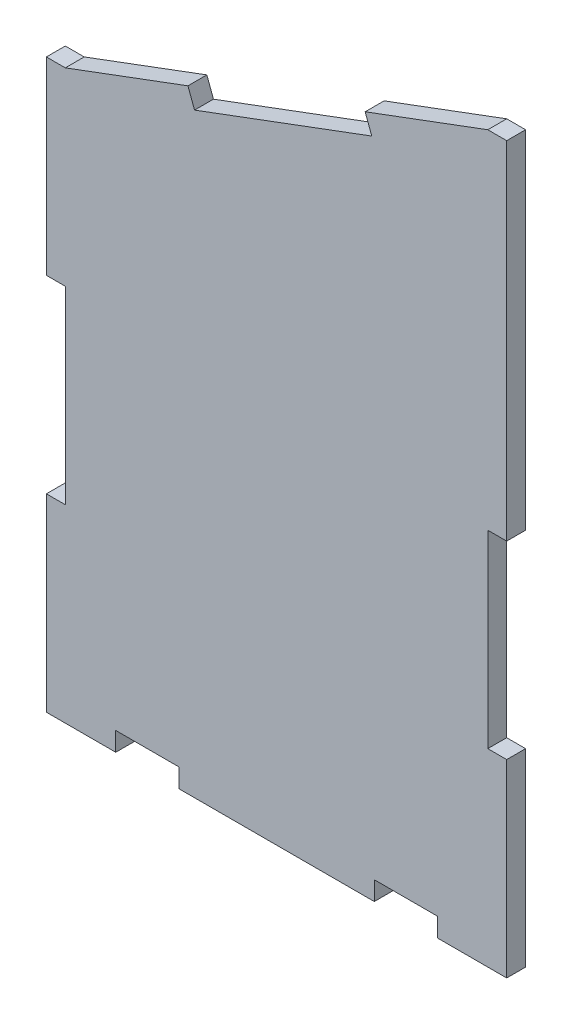
ISO-10303-21;
HEADER;
FILE_DESCRIPTION(('STEP AP214'),'2;1');
FILE_NAME('part.step','',(''),(''),'','','');
FILE_SCHEMA(('AUTOMOTIVE_DESIGN { 1 0 10303 214 1 1 1 1 }'));
ENDSEC;
DATA;
#1=APPLICATION_CONTEXT('core data for automotive mechanical design processes');
#2=APPLICATION_PROTOCOL_DEFINITION('international standard','automotive_design',2000,#1);
#3=PRODUCT_CONTEXT('',#1,'mechanical');
#4=PRODUCT('Part','Part','',(#3));
#5=PRODUCT_RELATED_PRODUCT_CATEGORY('part','',(#4));
#6=PRODUCT_DEFINITION_FORMATION('','',#4);
#7=PRODUCT_DEFINITION_CONTEXT('part definition',#1,'design');
#8=PRODUCT_DEFINITION('design','',#6,#7);
#9=PRODUCT_DEFINITION_SHAPE('','',#8);
#10=(LENGTH_UNIT() NAMED_UNIT(*) SI_UNIT(.MILLI.,.METRE.));
#11=(NAMED_UNIT(*) PLANE_ANGLE_UNIT() SI_UNIT($,.RADIAN.));
#12=(NAMED_UNIT(*) SI_UNIT($,.STERADIAN.) SOLID_ANGLE_UNIT());
#13=UNCERTAINTY_MEASURE_WITH_UNIT(LENGTH_MEASURE(1.E-05),#10,'distance_accuracy_value','');
#14=(GEOMETRIC_REPRESENTATION_CONTEXT(3) GLOBAL_UNCERTAINTY_ASSIGNED_CONTEXT((#13)) GLOBAL_UNIT_ASSIGNED_CONTEXT((#10,
#11,#12)) REPRESENTATION_CONTEXT('',''));
#15=CARTESIAN_POINT('',(0.,0.,0.));
#16=DIRECTION('',(0.,0.,1.));
#17=DIRECTION('',(1.,0.,0.));
#18=AXIS2_PLACEMENT_3D('',#15,#16,#17);
#19=CARTESIAN_POINT('',(271.856281381199,137.969765787973,3.));
#20=DIRECTION('',(-1.,0.,0.));
#21=DIRECTION('',(0.,0.,1.));
#22=AXIS2_PLACEMENT_3D('',#19,#20,#21);
#23=PLANE('',#22);
#24=DIRECTION('',(0.,1.,0.));
#25=VECTOR('',#24,1.);
#26=CARTESIAN_POINT('',(271.856281381199,137.969765787973,0.));
#27=LINE('',#26,#25);
#28=CARTESIAN_POINT('',(271.856281381199,134.969765787973,0.));
#29=VERTEX_POINT('',#28);
#30=CARTESIAN_POINT('',(271.856281381199,137.969765787973,0.));
#31=VERTEX_POINT('',#30);
#32=EDGE_CURVE('E237',#29,#31,#27,.T.);
#33=ORIENTED_EDGE('',*,*,#32,.T.);
#34=DIRECTION('',(0.,0.,-1.));
#35=VECTOR('',#34,1.);
#36=CARTESIAN_POINT('',(271.856281381199,137.969765787973,3.));
#37=LINE('',#36,#35);
#38=CARTESIAN_POINT('',(271.856281381199,137.969765787973,3.));
#39=VERTEX_POINT('',#38);
#40=EDGE_CURVE('E11',#39,#31,#37,.T.);
#41=ORIENTED_EDGE('',*,*,#40,.F.);
#42=DIRECTION('',(0.,1.,0.));
#43=VECTOR('',#42,1.);
#44=CARTESIAN_POINT('',(271.856281381199,137.969765787973,3.));
#45=LINE('',#44,#43);
#46=CARTESIAN_POINT('',(271.856281381199,134.969765787973,3.));
#47=VERTEX_POINT('',#46);
#48=EDGE_CURVE('E287',#47,#39,#45,.T.);
#49=ORIENTED_EDGE('',*,*,#48,.F.);
#50=DIRECTION('',(0.,0.,-1.));
#51=VECTOR('',#50,1.);
#52=CARTESIAN_POINT('',(271.856281381199,134.969765787973,3.));
#53=LINE('',#52,#51);
#54=EDGE_CURVE('E233',#47,#29,#53,.T.);
#55=ORIENTED_EDGE('',*,*,#54,.T.);
#56=EDGE_LOOP('',(#33,#41,#49,#55));
#57=FACE_BOUND('',#56,.T.);
#58=ADVANCED_FACE('F33',(#57),#23,.F.);
#59=CARTESIAN_POINT('',(281.856281381199,137.969765787973,3.));
#60=DIRECTION('',(0.,1.,0.));
#61=DIRECTION('',(-1.,0.,0.));
#62=AXIS2_PLACEMENT_3D('',#59,#60,#61);
#63=PLANE('',#62);
#64=DIRECTION('',(1.,0.,0.));
#65=VECTOR('',#64,1.);
#66=CARTESIAN_POINT('',(281.856281381199,137.969765787973,0.));
#67=LINE('',#66,#65);
#68=CARTESIAN_POINT('',(281.856281381199,137.969765787973,0.));
#69=VERTEX_POINT('',#68);
#70=EDGE_CURVE('E240',#31,#69,#67,.T.);
#71=ORIENTED_EDGE('',*,*,#70,.T.);
#72=DIRECTION('',(0.,0.,-1.));
#73=VECTOR('',#72,1.);
#74=CARTESIAN_POINT('',(281.856281381199,137.969765787973,3.));
#75=LINE('',#74,#73);
#76=CARTESIAN_POINT('',(281.856281381199,137.969765787973,3.));
#77=VERTEX_POINT('',#76);
#78=EDGE_CURVE('E41',#77,#69,#75,.T.);
#79=ORIENTED_EDGE('',*,*,#78,.F.);
#80=DIRECTION('',(1.,0.,0.));
#81=VECTOR('',#80,1.);
#82=CARTESIAN_POINT('',(281.856281381199,137.969765787973,3.));
#83=LINE('',#82,#81);
#84=EDGE_CURVE('E146',#39,#77,#83,.T.);
#85=ORIENTED_EDGE('',*,*,#84,.F.);
#86=ORIENTED_EDGE('',*,*,#40,.T.);
#87=EDGE_LOOP('',(#71,#79,#85,#86));
#88=FACE_BOUND('',#87,.T.);
#89=ADVANCED_FACE('F435',(#88),#63,.F.);
#90=CARTESIAN_POINT('',(281.856281381199,134.969765787973,3.));
#91=DIRECTION('',(1.,0.,0.));
#92=DIRECTION('',(0.,0.,-1.));
#93=AXIS2_PLACEMENT_3D('',#90,#91,#92);
#94=PLANE('',#93);
#95=DIRECTION('',(0.,-1.,0.));
#96=VECTOR('',#95,1.);
#97=CARTESIAN_POINT('',(281.856281381199,134.969765787973,0.));
#98=LINE('',#97,#96);
#99=CARTESIAN_POINT('',(281.856281381199,134.969765787973,0.));
#100=VERTEX_POINT('',#99);
#101=EDGE_CURVE('E242',#69,#100,#98,.T.);
#102=ORIENTED_EDGE('',*,*,#101,.T.);
#103=DIRECTION('',(0.,0.,-1.));
#104=VECTOR('',#103,1.);
#105=CARTESIAN_POINT('',(281.856281381199,134.969765787973,3.));
#106=LINE('',#105,#104);
#107=CARTESIAN_POINT('',(281.856281381199,134.969765787973,3.));
#108=VERTEX_POINT('',#107);
#109=EDGE_CURVE('E348',#108,#100,#106,.T.);
#110=ORIENTED_EDGE('',*,*,#109,.F.);
#111=DIRECTION('',(0.,-1.,0.));
#112=VECTOR('',#111,1.);
#113=CARTESIAN_POINT('',(281.856281381199,134.969765787973,3.));
#114=LINE('',#113,#112);
#115=EDGE_CURVE('E356',#77,#108,#114,.T.);
#116=ORIENTED_EDGE('',*,*,#115,.F.);
#117=ORIENTED_EDGE('',*,*,#78,.T.);
#118=EDGE_LOOP('',(#102,#110,#116,#117));
#119=FACE_BOUND('',#118,.T.);
#120=ADVANCED_FACE('F354',(#119),#94,.F.);
#121=CARTESIAN_POINT('',(292.856281381199,134.969765787973,3.));
#122=DIRECTION('',(0.,1.,0.));
#123=DIRECTION('',(-1.,0.,0.));
#124=AXIS2_PLACEMENT_3D('',#121,#122,#123);
#125=PLANE('',#124);
#126=DIRECTION('',(1.,0.,0.));
#127=VECTOR('',#126,1.);
#128=CARTESIAN_POINT('',(292.856281381199,134.969765787973,0.));
#129=LINE('',#128,#127);
#130=CARTESIAN_POINT('',(292.856281381199,134.969765787973,0.));
#131=VERTEX_POINT('',#130);
#132=EDGE_CURVE('E244',#100,#131,#129,.T.);
#133=ORIENTED_EDGE('',*,*,#132,.T.);
#134=DIRECTION('',(0.,0.,-1.));
#135=VECTOR('',#134,1.);
#136=CARTESIAN_POINT('',(292.856281381199,134.969765787973,3.));
#137=LINE('',#136,#135);
#138=CARTESIAN_POINT('',(292.856281381199,134.969765787973,3.));
#139=VERTEX_POINT('',#138);
#140=EDGE_CURVE('E345',#139,#131,#137,.T.);
#141=ORIENTED_EDGE('',*,*,#140,.F.);
#142=DIRECTION('',(1.,0.,0.));
#143=VECTOR('',#142,1.);
#144=CARTESIAN_POINT('',(292.856281381199,134.969765787973,3.));
#145=LINE('',#144,#143);
#146=EDGE_CURVE('E374',#108,#139,#145,.T.);
#147=ORIENTED_EDGE('',*,*,#146,.F.);
#148=ORIENTED_EDGE('',*,*,#109,.T.);
#149=EDGE_LOOP('',(#133,#141,#147,#148));
#150=FACE_BOUND('',#149,.T.);
#151=ADVANCED_FACE('F365',(#150),#125,.F.);
#152=CARTESIAN_POINT('',(292.856281381199,164.969765787973,3.));
#153=DIRECTION('',(-1.,0.,0.));
#154=DIRECTION('',(0.,-1.,0.));
#155=AXIS2_PLACEMENT_3D('',#152,#153,#154);
#156=PLANE('',#155);
#157=DIRECTION('',(0.,1.,0.));
#158=VECTOR('',#157,1.);
#159=CARTESIAN_POINT('',(292.856281381199,164.969765787973,0.));
#160=LINE('',#159,#158);
#161=CARTESIAN_POINT('',(292.856281381199,164.969765787973,0.));
#162=VERTEX_POINT('',#161);
#163=EDGE_CURVE('E246',#131,#162,#160,.T.);
#164=ORIENTED_EDGE('',*,*,#163,.T.);
#165=DIRECTION('',(0.,0.,-1.));
#166=VECTOR('',#165,1.);
#167=CARTESIAN_POINT('',(292.856281381199,164.969765787973,3.));
#168=LINE('',#167,#166);
#169=CARTESIAN_POINT('',(292.856281381199,164.969765787973,3.));
#170=VERTEX_POINT('',#169);
#171=EDGE_CURVE('E342',#170,#162,#168,.T.);
#172=ORIENTED_EDGE('',*,*,#171,.F.);
#173=DIRECTION('',(0.,1.,0.));
#174=VECTOR('',#173,1.);
#175=CARTESIAN_POINT('',(292.856281381199,164.969765787973,3.));
#176=LINE('',#175,#174);
#177=EDGE_CURVE('E371',#139,#170,#176,.T.);
#178=ORIENTED_EDGE('',*,*,#177,.F.);
#179=ORIENTED_EDGE('',*,*,#140,.T.);
#180=EDGE_LOOP('',(#164,#172,#178,#179));
#181=FACE_BOUND('',#180,.T.);
#182=ADVANCED_FACE('F369',(#181),#156,.F.);
#183=CARTESIAN_POINT('',(289.856281381199,164.969765787973,3.));
#184=DIRECTION('',(0.,-1.,0.));
#185=DIRECTION('',(0.,0.,-1.));
#186=AXIS2_PLACEMENT_3D('',#183,#184,#185);
#187=PLANE('',#186);
#188=DIRECTION('',(-1.,0.,0.));
#189=VECTOR('',#188,1.);
#190=CARTESIAN_POINT('',(289.856281381199,164.969765787973,0.));
#191=LINE('',#190,#189);
#192=CARTESIAN_POINT('',(289.856281381199,164.969765787973,0.));
#193=VERTEX_POINT('',#192);
#194=EDGE_CURVE('E248',#162,#193,#191,.T.);
#195=ORIENTED_EDGE('',*,*,#194,.T.);
#196=DIRECTION('',(0.,0.,-1.));
#197=VECTOR('',#196,1.);
#198=CARTESIAN_POINT('',(289.856281381199,164.969765787973,3.));
#199=LINE('',#198,#197);
#200=CARTESIAN_POINT('',(289.856281381199,164.969765787973,3.));
#201=VERTEX_POINT('',#200);
#202=EDGE_CURVE('E339',#201,#193,#199,.T.);
#203=ORIENTED_EDGE('',*,*,#202,.F.);
#204=DIRECTION('',(-1.,0.,0.));
#205=VECTOR('',#204,1.);
#206=CARTESIAN_POINT('',(289.856281381199,164.969765787973,3.));
#207=LINE('',#206,#205);
#208=EDGE_CURVE('E373',#170,#201,#207,.T.);
#209=ORIENTED_EDGE('',*,*,#208,.F.);
#210=ORIENTED_EDGE('',*,*,#171,.T.);
#211=EDGE_LOOP('',(#195,#203,#209,#210));
#212=FACE_BOUND('',#211,.T.);
#213=ADVANCED_FACE('F448',(#212),#187,.F.);
#214=CARTESIAN_POINT('',(289.856281381199,194.969765787973,3.));
#215=DIRECTION('',(-1.,0.,0.));
#216=DIRECTION('',(0.,0.,1.));
#217=AXIS2_PLACEMENT_3D('',#214,#215,#216);
#218=PLANE('',#217);
#219=DIRECTION('',(0.,1.,0.));
#220=VECTOR('',#219,1.);
#221=CARTESIAN_POINT('',(289.856281381199,194.969765787973,0.));
#222=LINE('',#221,#220);
#223=CARTESIAN_POINT('',(289.856281381199,194.969765787973,0.));
#224=VERTEX_POINT('',#223);
#225=EDGE_CURVE('E250',#193,#224,#222,.T.);
#226=ORIENTED_EDGE('',*,*,#225,.T.);
#227=DIRECTION('',(0.,0.,-1.));
#228=VECTOR('',#227,1.);
#229=CARTESIAN_POINT('',(289.856281381199,194.969765787973,3.));
#230=LINE('',#229,#228);
#231=CARTESIAN_POINT('',(289.856281381199,194.969765787973,3.));
#232=VERTEX_POINT('',#231);
#233=EDGE_CURVE('E336',#232,#224,#230,.T.);
#234=ORIENTED_EDGE('',*,*,#233,.F.);
#235=DIRECTION('',(0.,1.,0.));
#236=VECTOR('',#235,1.);
#237=CARTESIAN_POINT('',(289.856281381199,194.969765787973,3.));
#238=LINE('',#237,#236);
#239=EDGE_CURVE('E376',#201,#232,#238,.T.);
#240=ORIENTED_EDGE('',*,*,#239,.F.);
#241=ORIENTED_EDGE('',*,*,#202,.T.);
#242=EDGE_LOOP('',(#226,#234,#240,#241));
#243=FACE_BOUND('',#242,.T.);
#244=ADVANCED_FACE('F451',(#243),#218,.F.);
#245=CARTESIAN_POINT('',(289.856281381199,194.969765787973,3.));
#246=DIRECTION('',(0.,1.,0.));
#247=DIRECTION('',(-1.,0.,0.));
#248=AXIS2_PLACEMENT_3D('',#245,#246,#247);
#249=PLANE('',#248);
#250=DIRECTION('',(1.,0.,0.));
#251=VECTOR('',#250,1.);
#252=CARTESIAN_POINT('',(289.856281381199,194.969765787973,0.));
#253=LINE('',#252,#251);
#254=CARTESIAN_POINT('',(292.856281381199,194.969765787973,0.));
#255=VERTEX_POINT('',#254);
#256=EDGE_CURVE('E252',#224,#255,#253,.T.);
#257=ORIENTED_EDGE('',*,*,#256,.T.);
#258=DIRECTION('',(0.,0.,-1.));
#259=VECTOR('',#258,1.);
#260=CARTESIAN_POINT('',(292.856281381199,194.969765787973,3.));
#261=LINE('',#260,#259);
#262=CARTESIAN_POINT('',(292.856281381199,194.969765787973,3.));
#263=VERTEX_POINT('',#262);
#264=EDGE_CURVE('E333',#263,#255,#261,.T.);
#265=ORIENTED_EDGE('',*,*,#264,.F.);
#266=DIRECTION('',(1.,0.,0.));
#267=VECTOR('',#266,1.);
#268=CARTESIAN_POINT('',(289.856281381199,194.969765787973,3.));
#269=LINE('',#268,#267);
#270=EDGE_CURVE('E382',#232,#263,#269,.T.);
#271=ORIENTED_EDGE('',*,*,#270,.F.);
#272=ORIENTED_EDGE('',*,*,#233,.T.);
#273=EDGE_LOOP('',(#257,#265,#271,#272));
#274=FACE_BOUND('',#273,.T.);
#275=ADVANCED_FACE('F455',(#274),#249,.F.);
#276=CARTESIAN_POINT('',(292.856281381199,249.969765787973,3.));
#277=DIRECTION('',(-1.,0.,0.));
#278=DIRECTION('',(0.,0.,1.));
#279=AXIS2_PLACEMENT_3D('',#276,#277,#278);
#280=PLANE('',#279);
#281=DIRECTION('',(0.,1.,0.));
#282=VECTOR('',#281,1.);
#283=CARTESIAN_POINT('',(292.856281381199,249.969765787973,0.));
#284=LINE('',#283,#282);
#285=CARTESIAN_POINT('',(292.856281381199,249.969765787973,0.));
#286=VERTEX_POINT('',#285);
#287=EDGE_CURVE('E254',#255,#286,#284,.T.);
#288=ORIENTED_EDGE('',*,*,#287,.T.);
#289=DIRECTION('',(0.,0.,-1.));
#290=VECTOR('',#289,1.);
#291=CARTESIAN_POINT('',(292.856281381199,249.969765787973,3.));
#292=LINE('',#291,#290);
#293=CARTESIAN_POINT('',(292.856281381199,249.969765787973,3.));
#294=VERTEX_POINT('',#293);
#295=EDGE_CURVE('E330',#294,#286,#292,.T.);
#296=ORIENTED_EDGE('',*,*,#295,.F.);
#297=DIRECTION('',(0.,1.,0.));
#298=VECTOR('',#297,1.);
#299=CARTESIAN_POINT('',(292.856281381199,249.969765787973,3.));
#300=LINE('',#299,#298);
#301=EDGE_CURVE('E384',#263,#294,#300,.T.);
#302=ORIENTED_EDGE('',*,*,#301,.F.);
#303=ORIENTED_EDGE('',*,*,#264,.T.);
#304=EDGE_LOOP('',(#288,#296,#302,#303));
#305=FACE_BOUND('',#304,.T.);
#306=ADVANCED_FACE('F459',(#305),#280,.F.);
#307=CARTESIAN_POINT('',(292.856281381199,249.969765787973,3.));
#308=DIRECTION('',(0.,-1.,0.));
#309=DIRECTION('',(1.,0.,0.));
#310=AXIS2_PLACEMENT_3D('',#307,#308,#309);
#311=PLANE('',#310);
#312=DIRECTION('',(-1.,0.,0.));
#313=VECTOR('',#312,1.);
#314=CARTESIAN_POINT('',(292.856281381199,249.969765787973,0.));
#315=LINE('',#314,#313);
#316=CARTESIAN_POINT('',(289.856281381199,249.969765787973,0.));
#317=VERTEX_POINT('',#316);
#318=EDGE_CURVE('E256',#286,#317,#315,.T.);
#319=ORIENTED_EDGE('',*,*,#318,.T.);
#320=DIRECTION('',(0.,0.,-1.));
#321=VECTOR('',#320,1.);
#322=CARTESIAN_POINT('',(289.856281381199,249.969765787973,3.));
#323=LINE('',#322,#321);
#324=CARTESIAN_POINT('',(289.856281381199,249.969765787973,3.));
#325=VERTEX_POINT('',#324);
#326=EDGE_CURVE('E327',#325,#317,#323,.T.);
#327=ORIENTED_EDGE('',*,*,#326,.F.);
#328=DIRECTION('',(-1.,0.,0.));
#329=VECTOR('',#328,1.);
#330=CARTESIAN_POINT('',(292.856281381199,249.969765787973,3.));
#331=LINE('',#330,#329);
#332=EDGE_CURVE('E386',#294,#325,#331,.T.);
#333=ORIENTED_EDGE('',*,*,#332,.F.);
#334=ORIENTED_EDGE('',*,*,#295,.T.);
#335=EDGE_LOOP('',(#319,#327,#333,#334));
#336=FACE_BOUND('',#335,.T.);
#337=ADVANCED_FACE('F463',(#336),#311,.F.);
#338=CARTESIAN_POINT('',(270.410545368415,242.71372859985,3.));
#339=DIRECTION('',(0.349597520791812,-0.936899980497501,0.));
#340=DIRECTION('',(0.936899980497501,0.349597520791812,0.));
#341=AXIS2_PLACEMENT_3D('',#338,#339,#340);
#342=PLANE('',#341);
#343=DIRECTION('',(-0.936899980497501,-0.349597520791812,0.));
#344=VECTOR('',#343,1.);
#345=CARTESIAN_POINT('',(270.410545368415,242.71372859985,0.));
#346=LINE('',#345,#344);
#347=CARTESIAN_POINT('',(270.410545368415,242.71372859985,0.));
#348=VERTEX_POINT('',#347);
#349=EDGE_CURVE('E258',#317,#348,#346,.T.);
#350=ORIENTED_EDGE('',*,*,#349,.T.);
#351=DIRECTION('',(0.,0.,-1.));
#352=VECTOR('',#351,1.);
#353=CARTESIAN_POINT('',(270.410545368415,242.71372859985,3.));
#354=LINE('',#353,#352);
#355=CARTESIAN_POINT('',(270.410545368415,242.71372859985,3.));
#356=VERTEX_POINT('',#355);
#357=EDGE_CURVE('E324',#356,#348,#354,.T.);
#358=ORIENTED_EDGE('',*,*,#357,.F.);
#359=DIRECTION('',(-0.936899980497501,-0.349597520791812,0.));
#360=VECTOR('',#359,1.);
#361=CARTESIAN_POINT('',(270.410545368415,242.71372859985,3.));
#362=LINE('',#361,#360);
#363=EDGE_CURVE('E388',#325,#356,#362,.T.);
#364=ORIENTED_EDGE('',*,*,#363,.F.);
#365=ORIENTED_EDGE('',*,*,#326,.T.);
#366=EDGE_LOOP('',(#350,#358,#364,#365));
#367=FACE_BOUND('',#366,.T.);
#368=ADVANCED_FACE('F467',(#367),#342,.F.);
#369=CARTESIAN_POINT('',(270.410545368415,242.71372859985,3.));
#370=DIRECTION('',(0.936899980497545,0.349597520791695,0.));
#371=DIRECTION('',(-0.349597520791695,0.936899980497545,0.));
#372=AXIS2_PLACEMENT_3D('',#369,#370,#371);
#373=PLANE('',#372);
#374=DIRECTION('',(0.349597520791695,-0.936899980497545,0.));
#375=VECTOR('',#374,1.);
#376=CARTESIAN_POINT('',(270.410545368415,242.71372859985,0.));
#377=LINE('',#376,#375);
#378=CARTESIAN_POINT('',(271.45933793079,239.903028658358,0.));
#379=VERTEX_POINT('',#378);
#380=EDGE_CURVE('E260',#348,#379,#377,.T.);
#381=ORIENTED_EDGE('',*,*,#380,.T.);
#382=DIRECTION('',(0.,0.,-1.));
#383=VECTOR('',#382,1.);
#384=CARTESIAN_POINT('',(271.45933793079,239.903028658358,3.));
#385=LINE('',#384,#383);
#386=CARTESIAN_POINT('',(271.45933793079,239.903028658358,3.));
#387=VERTEX_POINT('',#386);
#388=EDGE_CURVE('E321',#387,#379,#385,.T.);
#389=ORIENTED_EDGE('',*,*,#388,.F.);
#390=DIRECTION('',(0.349597520791695,-0.936899980497545,0.));
#391=VECTOR('',#390,1.);
#392=CARTESIAN_POINT('',(270.410545368415,242.71372859985,3.));
#393=LINE('',#392,#391);
#394=EDGE_CURVE('E390',#356,#387,#393,.T.);
#395=ORIENTED_EDGE('',*,*,#394,.F.);
#396=ORIENTED_EDGE('',*,*,#357,.T.);
#397=EDGE_LOOP('',(#381,#389,#395,#396));
#398=FACE_BOUND('',#397,.T.);
#399=ADVANCED_FACE('F471',(#398),#373,.F.);
#400=CARTESIAN_POINT('',(271.45933793079,239.903028658358,3.));
#401=DIRECTION('',(0.349597520791822,-0.936899980497498,0.));
#402=DIRECTION('',(0.936899980497498,0.349597520791822,0.));
#403=AXIS2_PLACEMENT_3D('',#400,#401,#402);
#404=PLANE('',#403);
#405=DIRECTION('',(-0.936899980497498,-0.349597520791822,0.));
#406=VECTOR('',#405,1.);
#407=CARTESIAN_POINT('',(271.45933793079,239.903028658358,0.));
#408=LINE('',#407,#406);
#409=CARTESIAN_POINT('',(243.352338515865,229.415103034603,0.));
#410=VERTEX_POINT('',#409);
#411=EDGE_CURVE('E262',#379,#410,#408,.T.);
#412=ORIENTED_EDGE('',*,*,#411,.T.);
#413=DIRECTION('',(0.,0.,-1.));
#414=VECTOR('',#413,1.);
#415=CARTESIAN_POINT('',(243.352338515865,229.415103034603,3.));
#416=LINE('',#415,#414);
#417=CARTESIAN_POINT('',(243.352338515865,229.415103034603,3.));
#418=VERTEX_POINT('',#417);
#419=EDGE_CURVE('E318',#418,#410,#416,.T.);
#420=ORIENTED_EDGE('',*,*,#419,.F.);
#421=DIRECTION('',(-0.936899980497498,-0.349597520791822,0.));
#422=VECTOR('',#421,1.);
#423=CARTESIAN_POINT('',(271.45933793079,239.903028658358,3.));
#424=LINE('',#423,#422);
#425=EDGE_CURVE('E392',#387,#418,#424,.T.);
#426=ORIENTED_EDGE('',*,*,#425,.F.);
#427=ORIENTED_EDGE('',*,*,#388,.T.);
#428=EDGE_LOOP('',(#412,#420,#426,#427));
#429=FACE_BOUND('',#428,.T.);
#430=ADVANCED_FACE('F475',(#429),#404,.F.);
#431=CARTESIAN_POINT('',(242.30354595349,232.225802976096,3.));
#432=DIRECTION('',(-0.936899980497509,-0.349597520791792,0.));
#433=DIRECTION('',(0.349597520791792,-0.936899980497509,0.));
#434=AXIS2_PLACEMENT_3D('',#431,#432,#433);
#435=PLANE('',#434);
#436=DIRECTION('',(-0.349597520791792,0.936899980497509,0.));
#437=VECTOR('',#436,1.);
#438=CARTESIAN_POINT('',(242.30354595349,232.225802976096,0.));
#439=LINE('',#438,#437);
#440=CARTESIAN_POINT('',(242.30354595349,232.225802976096,0.));
#441=VERTEX_POINT('',#440);
#442=EDGE_CURVE('E264',#410,#441,#439,.T.);
#443=ORIENTED_EDGE('',*,*,#442,.T.);
#444=DIRECTION('',(0.,0.,-1.));
#445=VECTOR('',#444,1.);
#446=CARTESIAN_POINT('',(242.30354595349,232.225802976096,3.));
#447=LINE('',#446,#445);
#448=CARTESIAN_POINT('',(242.30354595349,232.225802976096,3.));
#449=VERTEX_POINT('',#448);
#450=EDGE_CURVE('E315',#449,#441,#447,.T.);
#451=ORIENTED_EDGE('',*,*,#450,.F.);
#452=DIRECTION('',(-0.349597520791792,0.936899980497509,0.));
#453=VECTOR('',#452,1.);
#454=CARTESIAN_POINT('',(242.30354595349,232.225802976096,3.));
#455=LINE('',#454,#453);
#456=EDGE_CURVE('E394',#418,#449,#455,.T.);
#457=ORIENTED_EDGE('',*,*,#456,.F.);
#458=ORIENTED_EDGE('',*,*,#419,.T.);
#459=EDGE_LOOP('',(#443,#451,#457,#458));
#460=FACE_BOUND('',#459,.T.);
#461=ADVANCED_FACE('F479',(#460),#435,.F.);
#462=CARTESIAN_POINT('',(222.857809940707,224.969765787973,3.));
#463=DIRECTION('',(0.349597520791819,-0.936899980497499,0.));
#464=DIRECTION('',(0.936899980497499,0.349597520791819,0.));
#465=AXIS2_PLACEMENT_3D('',#462,#463,#464);
#466=PLANE('',#465);
#467=DIRECTION('',(-0.936899980497499,-0.349597520791819,0.));
#468=VECTOR('',#467,1.);
#469=CARTESIAN_POINT('',(222.857809940707,224.969765787973,0.));
#470=LINE('',#469,#468);
#471=CARTESIAN_POINT('',(222.857809940707,224.969765787973,0.));
#472=VERTEX_POINT('',#471);
#473=EDGE_CURVE('E266',#441,#472,#470,.T.);
#474=ORIENTED_EDGE('',*,*,#473,.T.);
#475=DIRECTION('',(0.,0.,-1.));
#476=VECTOR('',#475,1.);
#477=CARTESIAN_POINT('',(222.857809940707,224.969765787973,3.));
#478=LINE('',#477,#476);
#479=CARTESIAN_POINT('',(222.857809940707,224.969765787973,3.));
#480=VERTEX_POINT('',#479);
#481=EDGE_CURVE('E312',#480,#472,#478,.T.);
#482=ORIENTED_EDGE('',*,*,#481,.F.);
#483=DIRECTION('',(-0.936899980497499,-0.349597520791819,0.));
#484=VECTOR('',#483,1.);
#485=CARTESIAN_POINT('',(222.857809940707,224.969765787973,3.));
#486=LINE('',#485,#484);
#487=EDGE_CURVE('E396',#449,#480,#486,.T.);
#488=ORIENTED_EDGE('',*,*,#487,.F.);
#489=ORIENTED_EDGE('',*,*,#450,.T.);
#490=EDGE_LOOP('',(#474,#482,#488,#489));
#491=FACE_BOUND('',#490,.T.);
#492=ADVANCED_FACE('F483',(#491),#466,.F.);
#493=CARTESIAN_POINT('',(219.857809940707,224.969765787973,3.));
#494=DIRECTION('',(0.,-1.,0.));
#495=DIRECTION('',(0.,0.,-1.));
#496=AXIS2_PLACEMENT_3D('',#493,#494,#495);
#497=PLANE('',#496);
#498=DIRECTION('',(-1.,0.,0.));
#499=VECTOR('',#498,1.);
#500=CARTESIAN_POINT('',(219.857809940707,224.969765787973,0.));
#501=LINE('',#500,#499);
#502=CARTESIAN_POINT('',(219.857809940707,224.969765787973,0.));
#503=VERTEX_POINT('',#502);
#504=EDGE_CURVE('E268',#472,#503,#501,.T.);
#505=ORIENTED_EDGE('',*,*,#504,.T.);
#506=DIRECTION('',(0.,0.,-1.));
#507=VECTOR('',#506,1.);
#508=CARTESIAN_POINT('',(219.857809940707,224.969765787973,3.));
#509=LINE('',#508,#507);
#510=CARTESIAN_POINT('',(219.857809940707,224.969765787973,3.));
#511=VERTEX_POINT('',#510);
#512=EDGE_CURVE('E309',#511,#503,#509,.T.);
#513=ORIENTED_EDGE('',*,*,#512,.F.);
#514=DIRECTION('',(-1.,0.,0.));
#515=VECTOR('',#514,1.);
#516=CARTESIAN_POINT('',(219.857809940707,224.969765787973,3.));
#517=LINE('',#516,#515);
#518=EDGE_CURVE('E398',#480,#511,#517,.T.);
#519=ORIENTED_EDGE('',*,*,#518,.F.);
#520=ORIENTED_EDGE('',*,*,#481,.T.);
#521=EDGE_LOOP('',(#505,#513,#519,#520));
#522=FACE_BOUND('',#521,.T.);
#523=ADVANCED_FACE('F487',(#522),#497,.F.);
#524=CARTESIAN_POINT('',(219.857809940707,194.969765787973,3.));
#525=DIRECTION('',(1.,0.,0.));
#526=DIRECTION('',(0.,1.,0.));
#527=AXIS2_PLACEMENT_3D('',#524,#525,#526);
#528=PLANE('',#527);
#529=DIRECTION('',(0.,-1.,0.));
#530=VECTOR('',#529,1.);
#531=CARTESIAN_POINT('',(219.857809940707,194.969765787973,0.));
#532=LINE('',#531,#530);
#533=CARTESIAN_POINT('',(219.857809940707,194.969765787973,0.));
#534=VERTEX_POINT('',#533);
#535=EDGE_CURVE('E270',#503,#534,#532,.T.);
#536=ORIENTED_EDGE('',*,*,#535,.T.);
#537=DIRECTION('',(0.,0.,-1.));
#538=VECTOR('',#537,1.);
#539=CARTESIAN_POINT('',(219.857809940707,194.969765787973,3.));
#540=LINE('',#539,#538);
#541=CARTESIAN_POINT('',(219.857809940707,194.969765787973,3.));
#542=VERTEX_POINT('',#541);
#543=EDGE_CURVE('E306',#542,#534,#540,.T.);
#544=ORIENTED_EDGE('',*,*,#543,.F.);
#545=DIRECTION('',(0.,-1.,0.));
#546=VECTOR('',#545,1.);
#547=CARTESIAN_POINT('',(219.857809940707,194.969765787973,3.));
#548=LINE('',#547,#546);
#549=EDGE_CURVE('E400',#511,#542,#548,.T.);
#550=ORIENTED_EDGE('',*,*,#549,.F.);
#551=ORIENTED_EDGE('',*,*,#512,.T.);
#552=EDGE_LOOP('',(#536,#544,#550,#551));
#553=FACE_BOUND('',#552,.T.);
#554=ADVANCED_FACE('F491',(#553),#528,.F.);
#555=CARTESIAN_POINT('',(222.857809940707,194.969765787973,3.));
#556=DIRECTION('',(0.,1.,0.));
#557=DIRECTION('',(0.,0.,1.));
#558=AXIS2_PLACEMENT_3D('',#555,#556,#557);
#559=PLANE('',#558);
#560=DIRECTION('',(1.,0.,0.));
#561=VECTOR('',#560,1.);
#562=CARTESIAN_POINT('',(222.857809940707,194.969765787973,0.));
#563=LINE('',#562,#561);
#564=CARTESIAN_POINT('',(222.857809940707,194.969765787973,0.));
#565=VERTEX_POINT('',#564);
#566=EDGE_CURVE('E272',#534,#565,#563,.T.);
#567=ORIENTED_EDGE('',*,*,#566,.T.);
#568=DIRECTION('',(0.,0.,-1.));
#569=VECTOR('',#568,1.);
#570=CARTESIAN_POINT('',(222.857809940707,194.969765787973,3.));
#571=LINE('',#570,#569);
#572=CARTESIAN_POINT('',(222.857809940707,194.969765787973,3.));
#573=VERTEX_POINT('',#572);
#574=EDGE_CURVE('E303',#573,#565,#571,.T.);
#575=ORIENTED_EDGE('',*,*,#574,.F.);
#576=DIRECTION('',(1.,0.,0.));
#577=VECTOR('',#576,1.);
#578=CARTESIAN_POINT('',(222.857809940707,194.969765787973,3.));
#579=LINE('',#578,#577);
#580=EDGE_CURVE('E402',#542,#573,#579,.T.);
#581=ORIENTED_EDGE('',*,*,#580,.F.);
#582=ORIENTED_EDGE('',*,*,#543,.T.);
#583=EDGE_LOOP('',(#567,#575,#581,#582));
#584=FACE_BOUND('',#583,.T.);
#585=ADVANCED_FACE('F495',(#584),#559,.F.);
#586=CARTESIAN_POINT('',(222.857809940707,164.969765787973,3.));
#587=DIRECTION('',(1.,0.,0.));
#588=DIRECTION('',(0.,1.,0.));
#589=AXIS2_PLACEMENT_3D('',#586,#587,#588);
#590=PLANE('',#589);
#591=DIRECTION('',(0.,-1.,0.));
#592=VECTOR('',#591,1.);
#593=CARTESIAN_POINT('',(222.857809940707,164.969765787973,0.));
#594=LINE('',#593,#592);
#595=CARTESIAN_POINT('',(222.857809940707,164.969765787973,0.));
#596=VERTEX_POINT('',#595);
#597=EDGE_CURVE('E274',#565,#596,#594,.T.);
#598=ORIENTED_EDGE('',*,*,#597,.T.);
#599=DIRECTION('',(0.,0.,-1.));
#600=VECTOR('',#599,1.);
#601=CARTESIAN_POINT('',(222.857809940707,164.969765787973,3.));
#602=LINE('',#601,#600);
#603=CARTESIAN_POINT('',(222.857809940707,164.969765787973,3.));
#604=VERTEX_POINT('',#603);
#605=EDGE_CURVE('E300',#604,#596,#602,.T.);
#606=ORIENTED_EDGE('',*,*,#605,.F.);
#607=DIRECTION('',(0.,-1.,0.));
#608=VECTOR('',#607,1.);
#609=CARTESIAN_POINT('',(222.857809940707,164.969765787973,3.));
#610=LINE('',#609,#608);
#611=EDGE_CURVE('E404',#573,#604,#610,.T.);
#612=ORIENTED_EDGE('',*,*,#611,.F.);
#613=ORIENTED_EDGE('',*,*,#574,.T.);
#614=EDGE_LOOP('',(#598,#606,#612,#613));
#615=FACE_BOUND('',#614,.T.);
#616=ADVANCED_FACE('F499',(#615),#590,.F.);
#617=CARTESIAN_POINT('',(219.857809940707,164.969765787973,3.));
#618=DIRECTION('',(0.,-1.,0.));
#619=DIRECTION('',(1.,0.,0.));
#620=AXIS2_PLACEMENT_3D('',#617,#618,#619);
#621=PLANE('',#620);
#622=DIRECTION('',(-1.,0.,0.));
#623=VECTOR('',#622,1.);
#624=CARTESIAN_POINT('',(219.857809940707,164.969765787973,0.));
#625=LINE('',#624,#623);
#626=CARTESIAN_POINT('',(219.857809940707,164.969765787973,0.));
#627=VERTEX_POINT('',#626);
#628=EDGE_CURVE('E276',#596,#627,#625,.T.);
#629=ORIENTED_EDGE('',*,*,#628,.T.);
#630=DIRECTION('',(0.,0.,-1.));
#631=VECTOR('',#630,1.);
#632=CARTESIAN_POINT('',(219.857809940707,164.969765787973,3.));
#633=LINE('',#632,#631);
#634=CARTESIAN_POINT('',(219.857809940707,164.969765787973,3.));
#635=VERTEX_POINT('',#634);
#636=EDGE_CURVE('E297',#635,#627,#633,.T.);
#637=ORIENTED_EDGE('',*,*,#636,.F.);
#638=DIRECTION('',(-1.,0.,0.));
#639=VECTOR('',#638,1.);
#640=CARTESIAN_POINT('',(219.857809940707,164.969765787973,3.));
#641=LINE('',#640,#639);
#642=EDGE_CURVE('E406',#604,#635,#641,.T.);
#643=ORIENTED_EDGE('',*,*,#642,.F.);
#644=ORIENTED_EDGE('',*,*,#605,.T.);
#645=EDGE_LOOP('',(#629,#637,#643,#644));
#646=FACE_BOUND('',#645,.T.);
#647=ADVANCED_FACE('F503',(#646),#621,.F.);
#648=CARTESIAN_POINT('',(219.857809940707,134.969765787973,3.));
#649=DIRECTION('',(1.,0.,0.));
#650=DIRECTION('',(0.,0.,-1.));
#651=AXIS2_PLACEMENT_3D('',#648,#649,#650);
#652=PLANE('',#651);
#653=DIRECTION('',(0.,-1.,0.));
#654=VECTOR('',#653,1.);
#655=CARTESIAN_POINT('',(219.857809940707,134.969765787973,0.));
#656=LINE('',#655,#654);
#657=CARTESIAN_POINT('',(219.857809940707,134.969765787973,0.));
#658=VERTEX_POINT('',#657);
#659=EDGE_CURVE('E278',#627,#658,#656,.T.);
#660=ORIENTED_EDGE('',*,*,#659,.T.);
#661=DIRECTION('',(0.,0.,-1.));
#662=VECTOR('',#661,1.);
#663=CARTESIAN_POINT('',(219.857809940707,134.969765787973,3.));
#664=LINE('',#663,#662);
#665=CARTESIAN_POINT('',(219.857809940707,134.969765787973,3.));
#666=VERTEX_POINT('',#665);
#667=EDGE_CURVE('E294',#666,#658,#664,.T.);
#668=ORIENTED_EDGE('',*,*,#667,.F.);
#669=DIRECTION('',(0.,-1.,0.));
#670=VECTOR('',#669,1.);
#671=CARTESIAN_POINT('',(219.857809940707,134.969765787973,3.));
#672=LINE('',#671,#670);
#673=EDGE_CURVE('E408',#635,#666,#672,.T.);
#674=ORIENTED_EDGE('',*,*,#673,.F.);
#675=ORIENTED_EDGE('',*,*,#636,.T.);
#676=EDGE_LOOP('',(#660,#668,#674,#675));
#677=FACE_BOUND('',#676,.T.);
#678=ADVANCED_FACE('F507',(#677),#652,.F.);
#679=CARTESIAN_POINT('',(230.857809940707,134.969765787973,3.));
#680=DIRECTION('',(0.,1.,0.));
#681=DIRECTION('',(-1.,0.,0.));
#682=AXIS2_PLACEMENT_3D('',#679,#680,#681);
#683=PLANE('',#682);
#684=DIRECTION('',(1.,0.,0.));
#685=VECTOR('',#684,1.);
#686=CARTESIAN_POINT('',(230.857809940707,134.969765787973,0.));
#687=LINE('',#686,#685);
#688=CARTESIAN_POINT('',(230.857809940707,134.969765787973,0.));
#689=VERTEX_POINT('',#688);
#690=EDGE_CURVE('E280',#658,#689,#687,.T.);
#691=ORIENTED_EDGE('',*,*,#690,.T.);
#692=DIRECTION('',(0.,0.,-1.));
#693=VECTOR('',#692,1.);
#694=CARTESIAN_POINT('',(230.857809940707,134.969765787973,3.));
#695=LINE('',#694,#693);
#696=CARTESIAN_POINT('',(230.857809940707,134.969765787973,3.));
#697=VERTEX_POINT('',#696);
#698=EDGE_CURVE('E291',#697,#689,#695,.T.);
#699=ORIENTED_EDGE('',*,*,#698,.F.);
#700=DIRECTION('',(1.,0.,0.));
#701=VECTOR('',#700,1.);
#702=CARTESIAN_POINT('',(230.857809940707,134.969765787973,3.));
#703=LINE('',#702,#701);
#704=EDGE_CURVE('E410',#666,#697,#703,.T.);
#705=ORIENTED_EDGE('',*,*,#704,.F.);
#706=ORIENTED_EDGE('',*,*,#667,.T.);
#707=EDGE_LOOP('',(#691,#699,#705,#706));
#708=FACE_BOUND('',#707,.T.);
#709=ADVANCED_FACE('F416',(#708),#683,.F.);
#710=CARTESIAN_POINT('',(230.857809940707,137.969765787973,3.));
#711=DIRECTION('',(-1.,0.,0.));
#712=DIRECTION('',(0.,0.,1.));
#713=AXIS2_PLACEMENT_3D('',#710,#711,#712);
#714=PLANE('',#713);
#715=DIRECTION('',(0.,1.,0.));
#716=VECTOR('',#715,1.);
#717=CARTESIAN_POINT('',(230.857809940707,137.969765787973,0.));
#718=LINE('',#717,#716);
#719=CARTESIAN_POINT('',(230.857809940707,137.969765787973,0.));
#720=VERTEX_POINT('',#719);
#721=EDGE_CURVE('E282',#689,#720,#718,.T.);
#722=ORIENTED_EDGE('',*,*,#721,.T.);
#723=DIRECTION('',(0.,0.,-1.));
#724=VECTOR('',#723,1.);
#725=CARTESIAN_POINT('',(230.857809940707,137.969765787973,3.));
#726=LINE('',#725,#724);
#727=CARTESIAN_POINT('',(230.857809940707,137.969765787973,3.));
#728=VERTEX_POINT('',#727);
#729=EDGE_CURVE('E228',#728,#720,#726,.T.);
#730=ORIENTED_EDGE('',*,*,#729,.F.);
#731=DIRECTION('',(0.,1.,0.));
#732=VECTOR('',#731,1.);
#733=CARTESIAN_POINT('',(230.857809940707,137.969765787973,3.));
#734=LINE('',#733,#732);
#735=EDGE_CURVE('E219',#697,#728,#734,.T.);
#736=ORIENTED_EDGE('',*,*,#735,.F.);
#737=ORIENTED_EDGE('',*,*,#698,.T.);
#738=EDGE_LOOP('',(#722,#730,#736,#737));
#739=FACE_BOUND('',#738,.T.);
#740=ADVANCED_FACE('F420',(#739),#714,.F.);
#741=CARTESIAN_POINT('',(240.857809940707,137.969765787973,3.));
#742=DIRECTION('',(0.,1.,0.));
#743=DIRECTION('',(0.,0.,1.));
#744=AXIS2_PLACEMENT_3D('',#741,#742,#743);
#745=PLANE('',#744);
#746=DIRECTION('',(1.,0.,0.));
#747=VECTOR('',#746,1.);
#748=CARTESIAN_POINT('',(240.857809940707,137.969765787973,0.));
#749=LINE('',#748,#747);
#750=CARTESIAN_POINT('',(240.857809940707,137.969765787973,0.));
#751=VERTEX_POINT('',#750);
#752=EDGE_CURVE('E227',#720,#751,#749,.T.);
#753=ORIENTED_EDGE('',*,*,#752,.T.);
#754=DIRECTION('',(0.,0.,-1.));
#755=VECTOR('',#754,1.);
#756=CARTESIAN_POINT('',(240.857809940707,137.969765787973,3.));
#757=LINE('',#756,#755);
#758=CARTESIAN_POINT('',(240.857809940707,137.969765787973,3.));
#759=VERTEX_POINT('',#758);
#760=EDGE_CURVE('E224',#759,#751,#757,.T.);
#761=ORIENTED_EDGE('',*,*,#760,.F.);
#762=DIRECTION('',(1.,0.,0.));
#763=VECTOR('',#762,1.);
#764=CARTESIAN_POINT('',(240.857809940707,137.969765787973,3.));
#765=LINE('',#764,#763);
#766=EDGE_CURVE('E213',#728,#759,#765,.T.);
#767=ORIENTED_EDGE('',*,*,#766,.F.);
#768=ORIENTED_EDGE('',*,*,#729,.T.);
#769=EDGE_LOOP('',(#753,#761,#767,#768));
#770=FACE_BOUND('',#769,.T.);
#771=ADVANCED_FACE('F225',(#770),#745,.F.);
#772=CARTESIAN_POINT('',(240.857809940707,134.969765787973,3.));
#773=DIRECTION('',(1.,0.,0.));
#774=DIRECTION('',(0.,0.,-1.));
#775=AXIS2_PLACEMENT_3D('',#772,#773,#774);
#776=PLANE('',#775);
#777=DIRECTION('',(0.,-1.,0.));
#778=VECTOR('',#777,1.);
#779=CARTESIAN_POINT('',(240.857809940707,134.969765787973,0.));
#780=LINE('',#779,#778);
#781=CARTESIAN_POINT('',(240.857809940707,134.969765787973,0.));
#782=VERTEX_POINT('',#781);
#783=EDGE_CURVE('E132',#751,#782,#780,.T.);
#784=ORIENTED_EDGE('',*,*,#783,.T.);
#785=DIRECTION('',(0.,0.,-1.));
#786=VECTOR('',#785,1.);
#787=CARTESIAN_POINT('',(240.857809940707,134.969765787973,3.));
#788=LINE('',#787,#786);
#789=CARTESIAN_POINT('',(240.857809940707,134.969765787973,3.));
#790=VERTEX_POINT('',#789);
#791=EDGE_CURVE('E229',#790,#782,#788,.T.);
#792=ORIENTED_EDGE('',*,*,#791,.F.);
#793=DIRECTION('',(0.,-1.,0.));
#794=VECTOR('',#793,1.);
#795=CARTESIAN_POINT('',(240.857809940707,134.969765787973,3.));
#796=LINE('',#795,#794);
#797=EDGE_CURVE('E217',#759,#790,#796,.T.);
#798=ORIENTED_EDGE('',*,*,#797,.F.);
#799=ORIENTED_EDGE('',*,*,#760,.T.);
#800=EDGE_LOOP('',(#784,#792,#798,#799));
#801=FACE_BOUND('',#800,.T.);
#802=ADVANCED_FACE('F231',(#801),#776,.F.);
#803=CARTESIAN_POINT('',(271.856281381199,134.969765787973,3.));
#804=DIRECTION('',(0.,1.,0.));
#805=DIRECTION('',(0.,0.,1.));
#806=AXIS2_PLACEMENT_3D('',#803,#804,#805);
#807=PLANE('',#806);
#808=DIRECTION('',(1.,0.,0.));
#809=VECTOR('',#808,1.);
#810=CARTESIAN_POINT('',(271.856281381199,134.969765787973,0.));
#811=LINE('',#810,#809);
#812=EDGE_CURVE('E138',#782,#29,#811,.T.);
#813=ORIENTED_EDGE('',*,*,#812,.T.);
#814=ORIENTED_EDGE('',*,*,#54,.F.);
#815=DIRECTION('',(1.,0.,0.));
#816=VECTOR('',#815,1.);
#817=CARTESIAN_POINT('',(271.856281381199,134.969765787973,3.));
#818=LINE('',#817,#816);
#819=EDGE_CURVE('E49',#790,#47,#818,.T.);
#820=ORIENTED_EDGE('',*,*,#819,.F.);
#821=ORIENTED_EDGE('',*,*,#791,.T.);
#822=EDGE_LOOP('',(#813,#814,#820,#821));
#823=FACE_BOUND('',#822,.T.);
#824=ADVANCED_FACE('F424',(#823),#807,.F.);
#825=CARTESIAN_POINT('',(0.,0.,3.));
#826=DIRECTION('',(0.,0.,-1.));
#827=DIRECTION('',(-1.,0.,0.));
#828=AXIS2_PLACEMENT_3D('',#825,#826,#827);
#829=PLANE('',#828);
#830=ORIENTED_EDGE('',*,*,#48,.T.);
#831=ORIENTED_EDGE('',*,*,#84,.T.);
#832=ORIENTED_EDGE('',*,*,#115,.T.);
#833=ORIENTED_EDGE('',*,*,#146,.T.);
#834=ORIENTED_EDGE('',*,*,#177,.T.);
#835=ORIENTED_EDGE('',*,*,#208,.T.);
#836=ORIENTED_EDGE('',*,*,#239,.T.);
#837=ORIENTED_EDGE('',*,*,#270,.T.);
#838=ORIENTED_EDGE('',*,*,#301,.T.);
#839=ORIENTED_EDGE('',*,*,#332,.T.);
#840=ORIENTED_EDGE('',*,*,#363,.T.);
#841=ORIENTED_EDGE('',*,*,#394,.T.);
#842=ORIENTED_EDGE('',*,*,#425,.T.);
#843=ORIENTED_EDGE('',*,*,#456,.T.);
#844=ORIENTED_EDGE('',*,*,#487,.T.);
#845=ORIENTED_EDGE('',*,*,#518,.T.);
#846=ORIENTED_EDGE('',*,*,#549,.T.);
#847=ORIENTED_EDGE('',*,*,#580,.T.);
#848=ORIENTED_EDGE('',*,*,#611,.T.);
#849=ORIENTED_EDGE('',*,*,#642,.T.);
#850=ORIENTED_EDGE('',*,*,#673,.T.);
#851=ORIENTED_EDGE('',*,*,#704,.T.);
#852=ORIENTED_EDGE('',*,*,#735,.T.);
#853=ORIENTED_EDGE('',*,*,#766,.T.);
#854=ORIENTED_EDGE('',*,*,#797,.T.);
#855=ORIENTED_EDGE('',*,*,#819,.T.);
#856=EDGE_LOOP('',(#830,#831,#832,#833,#834,#835,#836,#837,#838,#839,#840,#841,#842,#843,#844,
#845,#846,#847,#848,#849,#850,#851,#852,#853,#854,#855));
#857=FACE_BOUND('',#856,.T.);
#858=ADVANCED_FACE('F215',(#857),#829,.F.);
#859=CARTESIAN_POINT('',(0.,0.,0.));
#860=DIRECTION('',(0.,0.,-1.));
#861=DIRECTION('',(-1.,0.,0.));
#862=AXIS2_PLACEMENT_3D('',#859,#860,#861);
#863=PLANE('',#862);
#864=ORIENTED_EDGE('',*,*,#32,.F.);
#865=ORIENTED_EDGE('',*,*,#812,.F.);
#866=ORIENTED_EDGE('',*,*,#783,.F.);
#867=ORIENTED_EDGE('',*,*,#752,.F.);
#868=ORIENTED_EDGE('',*,*,#721,.F.);
#869=ORIENTED_EDGE('',*,*,#690,.F.);
#870=ORIENTED_EDGE('',*,*,#659,.F.);
#871=ORIENTED_EDGE('',*,*,#628,.F.);
#872=ORIENTED_EDGE('',*,*,#597,.F.);
#873=ORIENTED_EDGE('',*,*,#566,.F.);
#874=ORIENTED_EDGE('',*,*,#535,.F.);
#875=ORIENTED_EDGE('',*,*,#504,.F.);
#876=ORIENTED_EDGE('',*,*,#473,.F.);
#877=ORIENTED_EDGE('',*,*,#442,.F.);
#878=ORIENTED_EDGE('',*,*,#411,.F.);
#879=ORIENTED_EDGE('',*,*,#380,.F.);
#880=ORIENTED_EDGE('',*,*,#349,.F.);
#881=ORIENTED_EDGE('',*,*,#318,.F.);
#882=ORIENTED_EDGE('',*,*,#287,.F.);
#883=ORIENTED_EDGE('',*,*,#256,.F.);
#884=ORIENTED_EDGE('',*,*,#225,.F.);
#885=ORIENTED_EDGE('',*,*,#194,.F.);
#886=ORIENTED_EDGE('',*,*,#163,.F.);
#887=ORIENTED_EDGE('',*,*,#132,.F.);
#888=ORIENTED_EDGE('',*,*,#101,.F.);
#889=ORIENTED_EDGE('',*,*,#70,.F.);
#890=EDGE_LOOP('',(#864,#865,#866,#867,#868,#869,#870,#871,#872,#873,#874,#875,#876,#877,#878,
#879,#880,#881,#882,#883,#884,#885,#886,#887,#888,#889));
#891=FACE_BOUND('',#890,.T.);
#892=ADVANCED_FACE('F360',(#891),#863,.T.);
#893=CLOSED_SHELL('',(#58,#89,#120,#151,#182,#213,#244,#275,#306,#337,#368,#399,#430,#461,#492,
#523,#554,#585,#616,#647,#678,#709,#740,#771,#802,#824,#858,#892));
#894=MANIFOLD_SOLID_BREP('B2',#893);
#895=ADVANCED_BREP_SHAPE_REPRESENTATION('',(#18,#894),#14);
#896=SHAPE_DEFINITION_REPRESENTATION(#9,#895);
ENDSEC;
END-ISO-10303-21;
